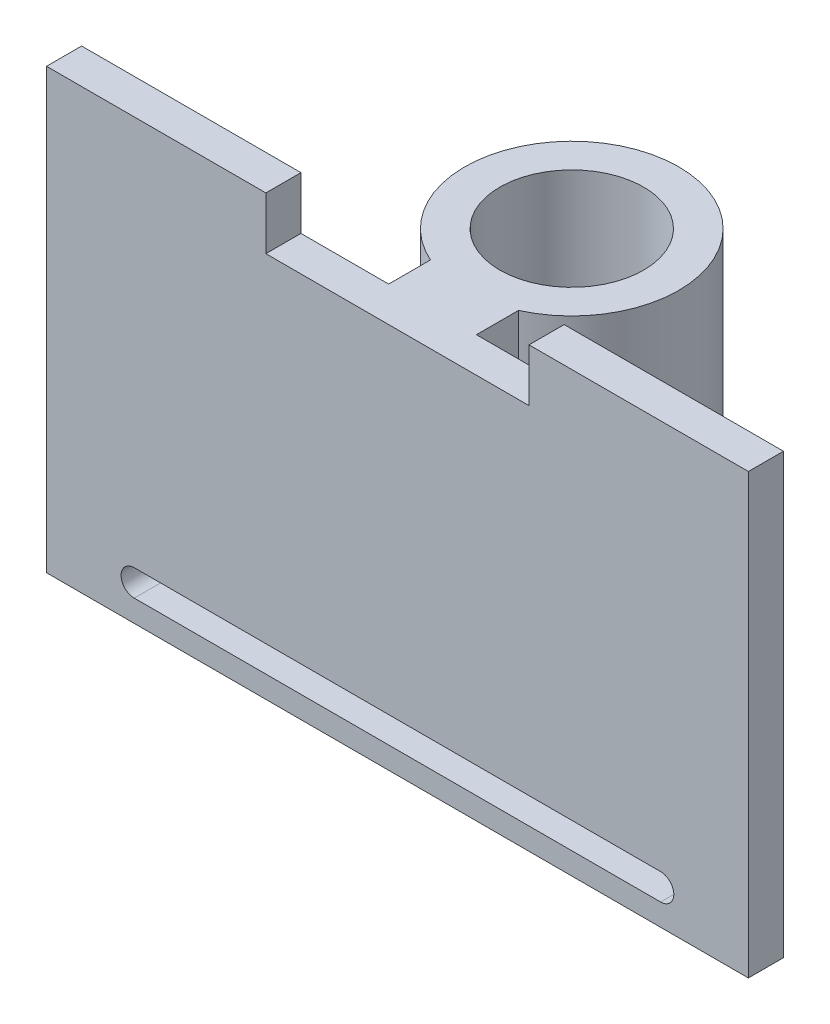
ISO-10303-21;
HEADER;
FILE_DESCRIPTION(('STEP AP214'),'2;1');
FILE_NAME('part.step','',(''),(''),'','','');
FILE_SCHEMA(('AUTOMOTIVE_DESIGN { 1 0 10303 214 1 1 1 1 }'));
ENDSEC;
DATA;
#1=APPLICATION_CONTEXT('core data for automotive mechanical design processes');
#2=APPLICATION_PROTOCOL_DEFINITION('international standard','automotive_design',2000,#1);
#3=PRODUCT_CONTEXT('',#1,'mechanical');
#4=PRODUCT('Part','Part','',(#3));
#5=PRODUCT_RELATED_PRODUCT_CATEGORY('part','',(#4));
#6=PRODUCT_DEFINITION_FORMATION('','',#4);
#7=PRODUCT_DEFINITION_CONTEXT('part definition',#1,'design');
#8=PRODUCT_DEFINITION('design','',#6,#7);
#9=PRODUCT_DEFINITION_SHAPE('','',#8);
#10=(LENGTH_UNIT() NAMED_UNIT(*) SI_UNIT(.MILLI.,.METRE.));
#11=(NAMED_UNIT(*) PLANE_ANGLE_UNIT() SI_UNIT($,.RADIAN.));
#12=(NAMED_UNIT(*) SI_UNIT($,.STERADIAN.) SOLID_ANGLE_UNIT());
#13=UNCERTAINTY_MEASURE_WITH_UNIT(LENGTH_MEASURE(1.E-05),#10,'distance_accuracy_value','');
#14=(GEOMETRIC_REPRESENTATION_CONTEXT(3) GLOBAL_UNCERTAINTY_ASSIGNED_CONTEXT((#13)) GLOBAL_UNIT_ASSIGNED_CONTEXT((#10,
#11,#12)) REPRESENTATION_CONTEXT('',''));
#15=CARTESIAN_POINT('',(0.,0.,0.));
#16=DIRECTION('',(0.,0.,1.));
#17=DIRECTION('',(1.,0.,0.));
#18=AXIS2_PLACEMENT_3D('',#15,#16,#17);
#19=CARTESIAN_POINT('',(0.,0.,0.));
#20=DIRECTION('',(0.,0.,1.));
#21=DIRECTION('',(1.,0.,0.));
#22=AXIS2_PLACEMENT_3D('',#19,#20,#21);
#23=PLANE('',#22);
#24=CARTESIAN_POINT('',(-7.66861629291625,-0.711459364865083,0.));
#25=DIRECTION('',(0.,0.,1.));
#26=DIRECTION('',(1.,0.,0.));
#27=AXIS2_PLACEMENT_3D('',#24,#25,#26);
#28=CIRCLE('',#27,0.750000000000003);
#29=CARTESIAN_POINT('',(-7.66861629291625,0.03854063513492,0.));
#30=VERTEX_POINT('',#29);
#31=CARTESIAN_POINT('',(-7.66861629291625,-1.46145936486509,0.));
#32=VERTEX_POINT('',#31);
#33=EDGE_CURVE('E219',#30,#32,#28,.T.);
#34=ORIENTED_EDGE('',*,*,#33,.T.);
#35=DIRECTION('',(1.,0.,0.));
#36=VECTOR('',#35,1.);
#37=CARTESIAN_POINT('',(-7.66861629291625,-1.46145936486509,0.));
#38=LINE('',#37,#36);
#39=CARTESIAN_POINT('',(22.3313837070837,-1.46145936486509,0.));
#40=VERTEX_POINT('',#39);
#41=EDGE_CURVE('E242',#32,#40,#38,.T.);
#42=ORIENTED_EDGE('',*,*,#41,.T.);
#43=CARTESIAN_POINT('',(22.3313837070837,-0.711459364865083,0.));
#44=DIRECTION('',(0.,0.,1.));
#45=DIRECTION('',(1.,0.,0.));
#46=AXIS2_PLACEMENT_3D('',#43,#44,#45);
#47=CIRCLE('',#46,0.750000000000003);
#48=CARTESIAN_POINT('',(22.3313837070837,0.03854063513492,0.));
#49=VERTEX_POINT('',#48);
#50=EDGE_CURVE('E246',#40,#49,#47,.T.);
#51=ORIENTED_EDGE('',*,*,#50,.T.);
#52=DIRECTION('',(-1.,0.,0.));
#53=VECTOR('',#52,1.);
#54=CARTESIAN_POINT('',(-7.66861629291625,0.03854063513492,0.));
#55=LINE('',#54,#53);
#56=EDGE_CURVE('E229',#49,#30,#55,.T.);
#57=ORIENTED_EDGE('',*,*,#56,.T.);
#58=EDGE_LOOP('',(#34,#42,#51,#57));
#59=FACE_BOUND('',#58,.T.);
#60=DIRECTION('',(0.,1.,0.));
#61=VECTOR('',#60,1.);
#62=CARTESIAN_POINT('',(4.83138370708375,4.28854063513492,0.));
#63=LINE('',#62,#61);
#64=CARTESIAN_POINT('',(4.83138370708375,4.28854063513492,0.));
#65=VERTEX_POINT('',#64);
#66=CARTESIAN_POINT('',(4.83138370708375,19.2885406351349,0.));
#67=VERTEX_POINT('',#66);
#68=EDGE_CURVE('E185',#65,#67,#63,.T.);
#69=ORIENTED_EDGE('',*,*,#68,.F.);
#70=DIRECTION('',(1.,0.,0.));
#71=VECTOR('',#70,1.);
#72=CARTESIAN_POINT('',(4.83138370708375,4.28854063513492,0.));
#73=LINE('',#72,#71);
#74=CARTESIAN_POINT('',(9.83138370708375,4.28854063513492,0.));
#75=VERTEX_POINT('',#74);
#76=EDGE_CURVE('E193',#65,#75,#73,.T.);
#77=ORIENTED_EDGE('',*,*,#76,.T.);
#78=DIRECTION('',(0.,1.,0.));
#79=VECTOR('',#78,1.);
#80=CARTESIAN_POINT('',(9.83138370708375,4.28854063513492,0.));
#81=LINE('',#80,#79);
#82=CARTESIAN_POINT('',(9.83138370708375,19.2885406351349,0.));
#83=VERTEX_POINT('',#82);
#84=EDGE_CURVE('E220',#75,#83,#81,.T.);
#85=ORIENTED_EDGE('',*,*,#84,.T.);
#86=DIRECTION('',(-1.,0.,0.));
#87=VECTOR('',#86,1.);
#88=CARTESIAN_POINT('',(-0.168616292916248,19.2885406351349,0.));
#89=LINE('',#88,#87);
#90=CARTESIAN_POINT('',(14.8313837070838,19.2885406351349,0.));
#91=VERTEX_POINT('',#90);
#92=EDGE_CURVE('E309',#91,#83,#89,.T.);
#93=ORIENTED_EDGE('',*,*,#92,.F.);
#94=DIRECTION('',(0.,-1.,0.));
#95=VECTOR('',#94,1.);
#96=CARTESIAN_POINT('',(14.8313837070838,22.2885406351349,0.));
#97=LINE('',#96,#95);
#98=CARTESIAN_POINT('',(14.8313837070838,22.2885406351349,0.));
#99=VERTEX_POINT('',#98);
#100=EDGE_CURVE('E305',#99,#91,#97,.T.);
#101=ORIENTED_EDGE('',*,*,#100,.F.);
#102=DIRECTION('',(-1.,0.,0.));
#103=VECTOR('',#102,1.);
#104=CARTESIAN_POINT('',(14.8313837070838,22.2885406351349,0.));
#105=LINE('',#104,#103);
#106=CARTESIAN_POINT('',(27.3313837070838,22.2885406351349,0.));
#107=VERTEX_POINT('',#106);
#108=EDGE_CURVE('E302',#107,#99,#105,.T.);
#109=ORIENTED_EDGE('',*,*,#108,.F.);
#110=DIRECTION('',(0.,1.,0.));
#111=VECTOR('',#110,1.);
#112=CARTESIAN_POINT('',(27.3313837070838,22.2885406351349,0.));
#113=LINE('',#112,#111);
#114=CARTESIAN_POINT('',(27.3313837070838,-2.71145936486508,0.));
#115=VERTEX_POINT('',#114);
#116=EDGE_CURVE('E299',#115,#107,#113,.T.);
#117=ORIENTED_EDGE('',*,*,#116,.F.);
#118=DIRECTION('',(1.,0.,0.));
#119=VECTOR('',#118,1.);
#120=CARTESIAN_POINT('',(-12.6686162929162,-2.71145936486508,0.));
#121=LINE('',#120,#119);
#122=CARTESIAN_POINT('',(-12.6686162929162,-2.71145936486508,0.));
#123=VERTEX_POINT('',#122);
#124=EDGE_CURVE('E296',#123,#115,#121,.T.);
#125=ORIENTED_EDGE('',*,*,#124,.F.);
#126=DIRECTION('',(0.,-1.,0.));
#127=VECTOR('',#126,1.);
#128=CARTESIAN_POINT('',(-12.6686162929163,22.2885406351349,0.));
#129=LINE('',#128,#127);
#130=CARTESIAN_POINT('',(-12.6686162929163,22.2885406351349,0.));
#131=VERTEX_POINT('',#130);
#132=EDGE_CURVE('E265',#131,#123,#129,.T.);
#133=ORIENTED_EDGE('',*,*,#132,.F.);
#134=DIRECTION('',(-1.,0.,0.));
#135=VECTOR('',#134,1.);
#136=CARTESIAN_POINT('',(-12.6686162929163,22.2885406351349,0.));
#137=LINE('',#136,#135);
#138=CARTESIAN_POINT('',(-0.168616292916248,22.2885406351349,0.));
#139=VERTEX_POINT('',#138);
#140=EDGE_CURVE('E271',#139,#131,#137,.T.);
#141=ORIENTED_EDGE('',*,*,#140,.F.);
#142=DIRECTION('',(0.,1.,0.));
#143=VECTOR('',#142,1.);
#144=CARTESIAN_POINT('',(-0.168616292916248,22.2885406351349,0.));
#145=LINE('',#144,#143);
#146=CARTESIAN_POINT('',(-0.168616292916248,19.2885406351349,0.));
#147=VERTEX_POINT('',#146);
#148=EDGE_CURVE('E313',#147,#139,#145,.T.);
#149=ORIENTED_EDGE('',*,*,#148,.F.);
#150=EDGE_CURVE('E308',#67,#147,#89,.T.);
#151=ORIENTED_EDGE('',*,*,#150,.F.);
#152=EDGE_LOOP('',(#69,#77,#85,#93,#101,#109,#117,#125,#133,#141,#149,#151));
#153=FACE_BOUND('',#152,.T.);
#154=ADVANCED_FACE('F58',(#59,#153),#23,.F.);
#155=CARTESIAN_POINT('',(0.,0.,2.));
#156=DIRECTION('',(0.,0.,1.));
#157=DIRECTION('',(1.,0.,0.));
#158=AXIS2_PLACEMENT_3D('',#155,#156,#157);
#159=PLANE('',#158);
#160=DIRECTION('',(0.,-1.,0.));
#161=VECTOR('',#160,1.);
#162=CARTESIAN_POINT('',(-12.6686162929163,22.2885406351349,2.));
#163=LINE('',#162,#161);
#164=CARTESIAN_POINT('',(-12.6686162929163,22.2885406351349,2.));
#165=VERTEX_POINT('',#164);
#166=CARTESIAN_POINT('',(-12.6686162929162,-2.71145936486508,2.));
#167=VERTEX_POINT('',#166);
#168=EDGE_CURVE('E266',#165,#167,#163,.T.);
#169=ORIENTED_EDGE('',*,*,#168,.T.);
#170=DIRECTION('',(1.,0.,0.));
#171=VECTOR('',#170,1.);
#172=CARTESIAN_POINT('',(-12.6686162929162,-2.71145936486508,2.));
#173=LINE('',#172,#171);
#174=CARTESIAN_POINT('',(27.3313837070838,-2.71145936486508,2.));
#175=VERTEX_POINT('',#174);
#176=EDGE_CURVE('E270',#167,#175,#173,.T.);
#177=ORIENTED_EDGE('',*,*,#176,.T.);
#178=DIRECTION('',(0.,1.,0.));
#179=VECTOR('',#178,1.);
#180=CARTESIAN_POINT('',(27.3313837070838,22.2885406351349,2.));
#181=LINE('',#180,#179);
#182=CARTESIAN_POINT('',(27.3313837070838,22.2885406351349,2.));
#183=VERTEX_POINT('',#182);
#184=EDGE_CURVE('E274',#175,#183,#181,.T.);
#185=ORIENTED_EDGE('',*,*,#184,.T.);
#186=DIRECTION('',(-1.,0.,0.));
#187=VECTOR('',#186,1.);
#188=CARTESIAN_POINT('',(14.8313837070838,22.2885406351349,2.));
#189=LINE('',#188,#187);
#190=CARTESIAN_POINT('',(14.8313837070838,22.2885406351349,2.));
#191=VERTEX_POINT('',#190);
#192=EDGE_CURVE('E277',#183,#191,#189,.T.);
#193=ORIENTED_EDGE('',*,*,#192,.T.);
#194=DIRECTION('',(0.,-1.,0.));
#195=VECTOR('',#194,1.);
#196=CARTESIAN_POINT('',(14.8313837070838,22.2885406351349,2.));
#197=LINE('',#196,#195);
#198=CARTESIAN_POINT('',(14.8313837070838,19.2885406351349,2.));
#199=VERTEX_POINT('',#198);
#200=EDGE_CURVE('E280',#191,#199,#197,.T.);
#201=ORIENTED_EDGE('',*,*,#200,.T.);
#202=DIRECTION('',(-1.,0.,0.));
#203=VECTOR('',#202,1.);
#204=CARTESIAN_POINT('',(-0.168616292916248,19.2885406351349,2.));
#205=LINE('',#204,#203);
#206=CARTESIAN_POINT('',(-0.168616292916248,19.2885406351349,2.));
#207=VERTEX_POINT('',#206);
#208=EDGE_CURVE('E283',#199,#207,#205,.T.);
#209=ORIENTED_EDGE('',*,*,#208,.T.);
#210=DIRECTION('',(0.,1.,0.));
#211=VECTOR('',#210,1.);
#212=CARTESIAN_POINT('',(-0.168616292916248,22.2885406351349,2.));
#213=LINE('',#212,#211);
#214=CARTESIAN_POINT('',(-0.168616292916248,22.2885406351349,2.));
#215=VERTEX_POINT('',#214);
#216=EDGE_CURVE('E286',#207,#215,#213,.T.);
#217=ORIENTED_EDGE('',*,*,#216,.T.);
#218=DIRECTION('',(-1.,0.,0.));
#219=VECTOR('',#218,1.);
#220=CARTESIAN_POINT('',(-12.6686162929163,22.2885406351349,2.));
#221=LINE('',#220,#219);
#222=EDGE_CURVE('E289',#215,#165,#221,.T.);
#223=ORIENTED_EDGE('',*,*,#222,.T.);
#224=EDGE_LOOP('',(#169,#177,#185,#193,#201,#209,#217,#223));
#225=FACE_BOUND('',#224,.T.);
#226=DIRECTION('',(1.,0.,0.));
#227=VECTOR('',#226,1.);
#228=CARTESIAN_POINT('',(-7.66861629291625,-1.46145936486509,2.));
#229=LINE('',#228,#227);
#230=CARTESIAN_POINT('',(-7.66861629291625,-1.46145936486509,2.));
#231=VERTEX_POINT('',#230);
#232=CARTESIAN_POINT('',(22.3313837070837,-1.46145936486509,2.));
#233=VERTEX_POINT('',#232);
#234=EDGE_CURVE('E228',#231,#233,#229,.T.);
#235=ORIENTED_EDGE('',*,*,#234,.F.);
#236=CARTESIAN_POINT('',(-7.66861629291625,-0.711459364865083,2.));
#237=DIRECTION('',(0.,0.,1.));
#238=DIRECTION('',(1.,0.,0.));
#239=AXIS2_PLACEMENT_3D('',#236,#237,#238);
#240=CIRCLE('',#239,0.750000000000003);
#241=CARTESIAN_POINT('',(-7.66861629291625,0.03854063513492,2.));
#242=VERTEX_POINT('',#241);
#243=EDGE_CURVE('E225',#242,#231,#240,.T.);
#244=ORIENTED_EDGE('',*,*,#243,.F.);
#245=DIRECTION('',(-1.,0.,0.));
#246=VECTOR('',#245,1.);
#247=CARTESIAN_POINT('',(-7.66861629291625,0.03854063513492,2.));
#248=LINE('',#247,#246);
#249=CARTESIAN_POINT('',(22.3313837070837,0.03854063513492,2.));
#250=VERTEX_POINT('',#249);
#251=EDGE_CURVE('E235',#250,#242,#248,.T.);
#252=ORIENTED_EDGE('',*,*,#251,.F.);
#253=CARTESIAN_POINT('',(22.3313837070837,-0.711459364865083,2.));
#254=DIRECTION('',(0.,0.,1.));
#255=DIRECTION('',(1.,0.,0.));
#256=AXIS2_PLACEMENT_3D('',#253,#254,#255);
#257=CIRCLE('',#256,0.750000000000003);
#258=EDGE_CURVE('E232',#233,#250,#257,.T.);
#259=ORIENTED_EDGE('',*,*,#258,.F.);
#260=EDGE_LOOP('',(#235,#244,#252,#259));
#261=FACE_BOUND('',#260,.T.);
#262=ADVANCED_FACE('F364',(#225,#261),#159,.T.);
#263=CARTESIAN_POINT('',(-12.6686162929163,22.2885406351349,2.));
#264=DIRECTION('',(1.,0.,0.));
#265=DIRECTION('',(0.,1.,0.));
#266=AXIS2_PLACEMENT_3D('',#263,#264,#265);
#267=PLANE('',#266);
#268=ORIENTED_EDGE('',*,*,#132,.T.);
#269=DIRECTION('',(0.,0.,-1.));
#270=VECTOR('',#269,1.);
#271=CARTESIAN_POINT('',(-12.6686162929162,-2.71145936486508,2.));
#272=LINE('',#271,#270);
#273=EDGE_CURVE('E12',#167,#123,#272,.T.);
#274=ORIENTED_EDGE('',*,*,#273,.F.);
#275=ORIENTED_EDGE('',*,*,#168,.F.);
#276=DIRECTION('',(0.,0.,-1.));
#277=VECTOR('',#276,1.);
#278=CARTESIAN_POINT('',(-12.6686162929163,22.2885406351349,2.));
#279=LINE('',#278,#277);
#280=EDGE_CURVE('E292',#165,#131,#279,.T.);
#281=ORIENTED_EDGE('',*,*,#280,.T.);
#282=EDGE_LOOP('',(#268,#274,#275,#281));
#283=FACE_BOUND('',#282,.T.);
#284=ADVANCED_FACE('F60',(#283),#267,.F.);
#285=CARTESIAN_POINT('',(-12.6686162929162,-2.71145936486508,2.));
#286=DIRECTION('',(0.,1.,0.));
#287=DIRECTION('',(0.,0.,1.));
#288=AXIS2_PLACEMENT_3D('',#285,#286,#287);
#289=PLANE('',#288);
#290=ORIENTED_EDGE('',*,*,#124,.T.);
#291=DIRECTION('',(0.,0.,-1.));
#292=VECTOR('',#291,1.);
#293=CARTESIAN_POINT('',(27.3313837070838,-2.71145936486508,2.));
#294=LINE('',#293,#292);
#295=EDGE_CURVE('E67',#175,#115,#294,.T.);
#296=ORIENTED_EDGE('',*,*,#295,.F.);
#297=ORIENTED_EDGE('',*,*,#176,.F.);
#298=ORIENTED_EDGE('',*,*,#273,.T.);
#299=EDGE_LOOP('',(#290,#296,#297,#298));
#300=FACE_BOUND('',#299,.T.);
#301=ADVANCED_FACE('F369',(#300),#289,.F.);
#302=CARTESIAN_POINT('',(27.3313837070838,22.2885406351349,2.));
#303=DIRECTION('',(-1.,0.,0.));
#304=DIRECTION('',(0.,0.,1.));
#305=AXIS2_PLACEMENT_3D('',#302,#303,#304);
#306=PLANE('',#305);
#307=ORIENTED_EDGE('',*,*,#116,.T.);
#308=DIRECTION('',(0.,0.,-1.));
#309=VECTOR('',#308,1.);
#310=CARTESIAN_POINT('',(27.3313837070838,22.2885406351349,2.));
#311=LINE('',#310,#309);
#312=EDGE_CURVE('E337',#183,#107,#311,.T.);
#313=ORIENTED_EDGE('',*,*,#312,.F.);
#314=ORIENTED_EDGE('',*,*,#184,.F.);
#315=ORIENTED_EDGE('',*,*,#295,.T.);
#316=EDGE_LOOP('',(#307,#313,#314,#315));
#317=FACE_BOUND('',#316,.T.);
#318=ADVANCED_FACE('F346',(#317),#306,.F.);
#319=CARTESIAN_POINT('',(14.8313837070838,22.2885406351349,2.));
#320=DIRECTION('',(0.,-1.,0.));
#321=DIRECTION('',(1.,0.,0.));
#322=AXIS2_PLACEMENT_3D('',#319,#320,#321);
#323=PLANE('',#322);
#324=ORIENTED_EDGE('',*,*,#108,.T.);
#325=DIRECTION('',(0.,0.,-1.));
#326=VECTOR('',#325,1.);
#327=CARTESIAN_POINT('',(14.8313837070838,22.2885406351349,2.));
#328=LINE('',#327,#326);
#329=EDGE_CURVE('E333',#191,#99,#328,.T.);
#330=ORIENTED_EDGE('',*,*,#329,.F.);
#331=ORIENTED_EDGE('',*,*,#192,.F.);
#332=ORIENTED_EDGE('',*,*,#312,.T.);
#333=EDGE_LOOP('',(#324,#330,#331,#332));
#334=FACE_BOUND('',#333,.T.);
#335=ADVANCED_FACE('F356',(#334),#323,.F.);
#336=CARTESIAN_POINT('',(14.8313837070838,22.2885406351349,2.));
#337=DIRECTION('',(1.,0.,0.));
#338=DIRECTION('',(0.,0.,-1.));
#339=AXIS2_PLACEMENT_3D('',#336,#337,#338);
#340=PLANE('',#339);
#341=ORIENTED_EDGE('',*,*,#100,.T.);
#342=DIRECTION('',(0.,0.,-1.));
#343=VECTOR('',#342,1.);
#344=CARTESIAN_POINT('',(14.8313837070838,19.2885406351349,2.));
#345=LINE('',#344,#343);
#346=EDGE_CURVE('E329',#199,#91,#345,.T.);
#347=ORIENTED_EDGE('',*,*,#346,.F.);
#348=ORIENTED_EDGE('',*,*,#200,.F.);
#349=ORIENTED_EDGE('',*,*,#329,.T.);
#350=EDGE_LOOP('',(#341,#347,#348,#349));
#351=FACE_BOUND('',#350,.T.);
#352=ADVANCED_FACE('F360',(#351),#340,.F.);
#353=CARTESIAN_POINT('',(-0.168616292916248,19.2885406351349,2.));
#354=DIRECTION('',(0.,-1.,0.));
#355=DIRECTION('',(0.,0.,-1.));
#356=AXIS2_PLACEMENT_3D('',#353,#354,#355);
#357=PLANE('',#356);
#358=ORIENTED_EDGE('',*,*,#92,.T.);
#359=DIRECTION('',(0.,0.,1.));
#360=VECTOR('',#359,1.);
#361=CARTESIAN_POINT('',(9.83138370708375,19.2885406351349,-2.39932332366425));
#362=LINE('',#361,#360);
#363=CARTESIAN_POINT('',(9.83138370708375,19.2885406351349,-2.39932332366425));
#364=VERTEX_POINT('',#363);
#365=EDGE_CURVE('E74',#364,#83,#362,.T.);
#366=ORIENTED_EDGE('',*,*,#365,.F.);
#367=CARTESIAN_POINT('',(7.31105850383172,19.2885406351349,-7.95431755137075));
#368=DIRECTION('',(0.,1.,0.));
#369=DIRECTION('',(0.,0.,1.));
#370=AXIS2_PLACEMENT_3D('',#367,#368,#369);
#371=CIRCLE('',#370,6.1);
#372=CARTESIAN_POINT('',(4.83138370708375,19.2885406351349,-2.38105881860292));
#373=VERTEX_POINT('',#372);
#374=EDGE_CURVE('E211',#364,#373,#371,.T.);
#375=ORIENTED_EDGE('',*,*,#374,.T.);
#376=DIRECTION('',(0.,0.,1.));
#377=VECTOR('',#376,1.);
#378=CARTESIAN_POINT('',(4.83138370708375,19.2885406351349,-2.38105881860292));
#379=LINE('',#378,#377);
#380=EDGE_CURVE('E179',#373,#67,#379,.T.);
#381=ORIENTED_EDGE('',*,*,#380,.T.);
#382=ORIENTED_EDGE('',*,*,#150,.T.);
#383=DIRECTION('',(0.,0.,-1.));
#384=VECTOR('',#383,1.);
#385=CARTESIAN_POINT('',(-0.168616292916248,19.2885406351349,2.));
#386=LINE('',#385,#384);
#387=EDGE_CURVE('E325',#207,#147,#386,.T.);
#388=ORIENTED_EDGE('',*,*,#387,.F.);
#389=ORIENTED_EDGE('',*,*,#208,.F.);
#390=ORIENTED_EDGE('',*,*,#346,.T.);
#391=EDGE_LOOP('',(#358,#366,#375,#381,#382,#388,#389,#390));
#392=FACE_BOUND('',#391,.T.);
#393=CARTESIAN_POINT('',(7.31105850383172,19.2885406351349,-7.95431755137075));
#394=DIRECTION('',(0.,1.,0.));
#395=DIRECTION('',(0.,0.,1.));
#396=AXIS2_PLACEMENT_3D('',#393,#394,#395);
#397=CIRCLE('',#396,4.1);
#398=CARTESIAN_POINT('',(7.31105850383172,19.2885406351349,-3.85431755137075));
#399=VERTEX_POINT('',#398);
#400=EDGE_CURVE('E204',#399,#399,#397,.T.);
#401=ORIENTED_EDGE('',*,*,#400,.F.);
#402=EDGE_LOOP('',(#401));
#403=FACE_BOUND('',#402,.T.);
#404=ADVANCED_FACE('F383',(#392,#403),#357,.F.);
#405=CARTESIAN_POINT('',(-0.168616292916248,22.2885406351349,2.));
#406=DIRECTION('',(-1.,0.,0.));
#407=DIRECTION('',(0.,0.,1.));
#408=AXIS2_PLACEMENT_3D('',#405,#406,#407);
#409=PLANE('',#408);
#410=ORIENTED_EDGE('',*,*,#148,.T.);
#411=DIRECTION('',(0.,0.,-1.));
#412=VECTOR('',#411,1.);
#413=CARTESIAN_POINT('',(-0.168616292916248,22.2885406351349,2.));
#414=LINE('',#413,#412);
#415=EDGE_CURVE('E321',#215,#139,#414,.T.);
#416=ORIENTED_EDGE('',*,*,#415,.F.);
#417=ORIENTED_EDGE('',*,*,#216,.F.);
#418=ORIENTED_EDGE('',*,*,#387,.T.);
#419=EDGE_LOOP('',(#410,#416,#417,#418));
#420=FACE_BOUND('',#419,.T.);
#421=ADVANCED_FACE('F381',(#420),#409,.F.);
#422=CARTESIAN_POINT('',(-12.6686162929163,22.2885406351349,2.));
#423=DIRECTION('',(0.,-1.,0.));
#424=DIRECTION('',(0.,0.,-1.));
#425=AXIS2_PLACEMENT_3D('',#422,#423,#424);
#426=PLANE('',#425);
#427=ORIENTED_EDGE('',*,*,#140,.T.);
#428=ORIENTED_EDGE('',*,*,#280,.F.);
#429=ORIENTED_EDGE('',*,*,#222,.F.);
#430=ORIENTED_EDGE('',*,*,#415,.T.);
#431=EDGE_LOOP('',(#427,#428,#429,#430));
#432=FACE_BOUND('',#431,.T.);
#433=ADVANCED_FACE('F376',(#432),#426,.F.);
#434=CARTESIAN_POINT('',(-7.66861629291625,-0.711459364865083,2.));
#435=DIRECTION('',(0.,0.,-1.));
#436=DIRECTION('',(-1.,0.,0.));
#437=AXIS2_PLACEMENT_3D('',#434,#435,#436);
#438=CYLINDRICAL_SURFACE('',#437,0.750000000000003);
#439=ORIENTED_EDGE('',*,*,#33,.F.);
#440=DIRECTION('',(0.,0.,-1.));
#441=VECTOR('',#440,1.);
#442=CARTESIAN_POINT('',(-7.66861629291625,0.03854063513492,2.));
#443=LINE('',#442,#441);
#444=EDGE_CURVE('E238',#242,#30,#443,.T.);
#445=ORIENTED_EDGE('',*,*,#444,.F.);
#446=ORIENTED_EDGE('',*,*,#243,.T.);
#447=DIRECTION('',(0.,0.,-1.));
#448=VECTOR('',#447,1.);
#449=CARTESIAN_POINT('',(-7.66861629291625,-1.46145936486509,2.));
#450=LINE('',#449,#448);
#451=EDGE_CURVE('E261',#231,#32,#450,.T.);
#452=ORIENTED_EDGE('',*,*,#451,.T.);
#453=EDGE_LOOP('',(#439,#445,#446,#452));
#454=FACE_BOUND('',#453,.T.);
#455=ADVANCED_FACE('F408',(#454),#438,.F.);
#456=CARTESIAN_POINT('',(-7.66861629291625,-1.46145936486509,2.));
#457=DIRECTION('',(0.,1.,0.));
#458=DIRECTION('',(0.,0.,1.));
#459=AXIS2_PLACEMENT_3D('',#456,#457,#458);
#460=PLANE('',#459);
#461=ORIENTED_EDGE('',*,*,#41,.F.);
#462=ORIENTED_EDGE('',*,*,#451,.F.);
#463=ORIENTED_EDGE('',*,*,#234,.T.);
#464=DIRECTION('',(0.,0.,-1.));
#465=VECTOR('',#464,1.);
#466=CARTESIAN_POINT('',(22.3313837070837,-1.46145936486509,2.));
#467=LINE('',#466,#465);
#468=EDGE_CURVE('E258',#233,#40,#467,.T.);
#469=ORIENTED_EDGE('',*,*,#468,.T.);
#470=EDGE_LOOP('',(#461,#462,#463,#469));
#471=FACE_BOUND('',#470,.T.);
#472=ADVANCED_FACE('F497',(#471),#460,.T.);
#473=CARTESIAN_POINT('',(22.3313837070837,-0.711459364865083,2.));
#474=DIRECTION('',(0.,0.,-1.));
#475=DIRECTION('',(-1.,0.,0.));
#476=AXIS2_PLACEMENT_3D('',#473,#474,#475);
#477=CYLINDRICAL_SURFACE('',#476,0.750000000000003);
#478=ORIENTED_EDGE('',*,*,#50,.F.);
#479=ORIENTED_EDGE('',*,*,#468,.F.);
#480=ORIENTED_EDGE('',*,*,#258,.T.);
#481=DIRECTION('',(0.,0.,-1.));
#482=VECTOR('',#481,1.);
#483=CARTESIAN_POINT('',(22.3313837070837,0.03854063513492,2.));
#484=LINE('',#483,#482);
#485=EDGE_CURVE('E82',#250,#49,#484,.T.);
#486=ORIENTED_EDGE('',*,*,#485,.T.);
#487=EDGE_LOOP('',(#478,#479,#480,#486));
#488=FACE_BOUND('',#487,.T.);
#489=ADVANCED_FACE('F507',(#488),#477,.F.);
#490=CARTESIAN_POINT('',(-7.66861629291625,0.03854063513492,2.));
#491=DIRECTION('',(0.,-1.,0.));
#492=DIRECTION('',(0.,0.,-1.));
#493=AXIS2_PLACEMENT_3D('',#490,#491,#492);
#494=PLANE('',#493);
#495=ORIENTED_EDGE('',*,*,#56,.F.);
#496=ORIENTED_EDGE('',*,*,#485,.F.);
#497=ORIENTED_EDGE('',*,*,#251,.T.);
#498=ORIENTED_EDGE('',*,*,#444,.T.);
#499=EDGE_LOOP('',(#495,#496,#497,#498));
#500=FACE_BOUND('',#499,.T.);
#501=ADVANCED_FACE('F394',(#500),#494,.T.);
#502=CARTESIAN_POINT('',(7.31105850383172,4.28854063513492,-7.95431755137075));
#503=DIRECTION('',(0.,1.,0.));
#504=DIRECTION('',(0.,0.,1.));
#505=AXIS2_PLACEMENT_3D('',#502,#503,#504);
#506=CYLINDRICAL_SURFACE('',#505,6.1);
#507=ORIENTED_EDGE('',*,*,#374,.F.);
#508=DIRECTION('',(0.,1.,0.));
#509=VECTOR('',#508,1.);
#510=CARTESIAN_POINT('',(9.83138370708375,4.28854063513492,-2.39932332366425));
#511=LINE('',#510,#509);
#512=CARTESIAN_POINT('',(9.83138370708375,4.28854063513492,-2.39932332366425));
#513=VERTEX_POINT('',#512);
#514=EDGE_CURVE('E197',#513,#364,#511,.T.);
#515=ORIENTED_EDGE('',*,*,#514,.F.);
#516=CARTESIAN_POINT('',(7.31105850383172,4.28854063513492,-7.95431755137075));
#517=DIRECTION('',(0.,1.,0.));
#518=DIRECTION('',(0.,0.,1.));
#519=AXIS2_PLACEMENT_3D('',#516,#517,#518);
#520=CIRCLE('',#519,6.1);
#521=CARTESIAN_POINT('',(4.83138370708375,4.28854063513492,-2.38105881860292));
#522=VERTEX_POINT('',#521);
#523=EDGE_CURVE('E191',#513,#522,#520,.T.);
#524=ORIENTED_EDGE('',*,*,#523,.T.);
#525=DIRECTION('',(0.,1.,0.));
#526=VECTOR('',#525,1.);
#527=CARTESIAN_POINT('',(4.83138370708375,4.28854063513492,-2.38105881860292));
#528=LINE('',#527,#526);
#529=EDGE_CURVE('E173',#522,#373,#528,.T.);
#530=ORIENTED_EDGE('',*,*,#529,.T.);
#531=EDGE_LOOP('',(#507,#515,#524,#530));
#532=FACE_BOUND('',#531,.T.);
#533=ADVANCED_FACE('F196',(#532),#506,.T.);
#534=CARTESIAN_POINT('',(9.83138370708375,4.28854063513492,-2.39932332366425));
#535=DIRECTION('',(-1.,0.,0.));
#536=DIRECTION('',(0.,0.,1.));
#537=AXIS2_PLACEMENT_3D('',#534,#535,#536);
#538=PLANE('',#537);
#539=ORIENTED_EDGE('',*,*,#365,.T.);
#540=ORIENTED_EDGE('',*,*,#84,.F.);
#541=DIRECTION('',(0.,0.,1.));
#542=VECTOR('',#541,1.);
#543=CARTESIAN_POINT('',(9.83138370708375,4.28854063513492,-2.39932332366425));
#544=LINE('',#543,#542);
#545=EDGE_CURVE('E186',#513,#75,#544,.T.);
#546=ORIENTED_EDGE('',*,*,#545,.F.);
#547=ORIENTED_EDGE('',*,*,#514,.T.);
#548=EDGE_LOOP('',(#539,#540,#546,#547));
#549=FACE_BOUND('',#548,.T.);
#550=ADVANCED_FACE('F386',(#549),#538,.F.);
#551=CARTESIAN_POINT('',(4.83138370708375,4.28854063513492,-2.38105881860292));
#552=DIRECTION('',(-1.,0.,0.));
#553=DIRECTION('',(0.,0.,1.));
#554=AXIS2_PLACEMENT_3D('',#551,#552,#553);
#555=PLANE('',#554);
#556=ORIENTED_EDGE('',*,*,#380,.F.);
#557=ORIENTED_EDGE('',*,*,#529,.F.);
#558=DIRECTION('',(0.,0.,1.));
#559=VECTOR('',#558,1.);
#560=CARTESIAN_POINT('',(4.83138370708375,4.28854063513492,-2.38105881860292));
#561=LINE('',#560,#559);
#562=EDGE_CURVE('E176',#522,#65,#561,.T.);
#563=ORIENTED_EDGE('',*,*,#562,.T.);
#564=ORIENTED_EDGE('',*,*,#68,.T.);
#565=EDGE_LOOP('',(#556,#557,#563,#564));
#566=FACE_BOUND('',#565,.T.);
#567=ADVANCED_FACE('F175',(#566),#555,.T.);
#568=CARTESIAN_POINT('',(7.31105850383172,4.28854063513492,-7.95431755137075));
#569=DIRECTION('',(0.,1.,0.));
#570=DIRECTION('',(0.,0.,1.));
#571=AXIS2_PLACEMENT_3D('',#568,#569,#570);
#572=PLANE('',#571);
#573=CARTESIAN_POINT('',(7.31105850383172,4.28854063513492,-7.95431755137075));
#574=DIRECTION('',(0.,1.,0.));
#575=DIRECTION('',(0.,0.,1.));
#576=AXIS2_PLACEMENT_3D('',#573,#574,#575);
#577=CIRCLE('',#576,4.1);
#578=CARTESIAN_POINT('',(7.31105850383172,4.28854063513492,-3.85431755137075));
#579=VERTEX_POINT('',#578);
#580=EDGE_CURVE('E214',#579,#579,#577,.T.);
#581=ORIENTED_EDGE('',*,*,#580,.T.);
#582=EDGE_LOOP('',(#581));
#583=FACE_BOUND('',#582,.T.);
#584=ORIENTED_EDGE('',*,*,#523,.F.);
#585=ORIENTED_EDGE('',*,*,#545,.T.);
#586=ORIENTED_EDGE('',*,*,#76,.F.);
#587=ORIENTED_EDGE('',*,*,#562,.F.);
#588=EDGE_LOOP('',(#584,#585,#586,#587));
#589=FACE_BOUND('',#588,.T.);
#590=ADVANCED_FACE('F190',(#583,#589),#572,.F.);
#591=CARTESIAN_POINT('',(7.31105850383172,4.28854063513492,-7.95431755137075));
#592=DIRECTION('',(0.,1.,0.));
#593=DIRECTION('',(0.,0.,1.));
#594=AXIS2_PLACEMENT_3D('',#591,#592,#593);
#595=CYLINDRICAL_SURFACE('',#594,4.1);
#596=ORIENTED_EDGE('',*,*,#580,.F.);
#597=EDGE_LOOP('',(#596));
#598=FACE_BOUND('',#597,.T.);
#599=ORIENTED_EDGE('',*,*,#400,.T.);
#600=EDGE_LOOP('',(#599));
#601=FACE_BOUND('',#600,.T.);
#602=ADVANCED_FACE('F556',(#598,#601),#595,.F.);
#603=CLOSED_SHELL('',(#154,#262,#284,#301,#318,#335,#352,#404,#421,#433,#455,#472,#489,#501,
#533,#550,#567,#590,#602));
#604=MANIFOLD_SOLID_BREP('B2',#603);
#605=ADVANCED_BREP_SHAPE_REPRESENTATION('',(#18,#604),#14);
#606=SHAPE_DEFINITION_REPRESENTATION(#9,#605);
ENDSEC;
END-ISO-10303-21;
